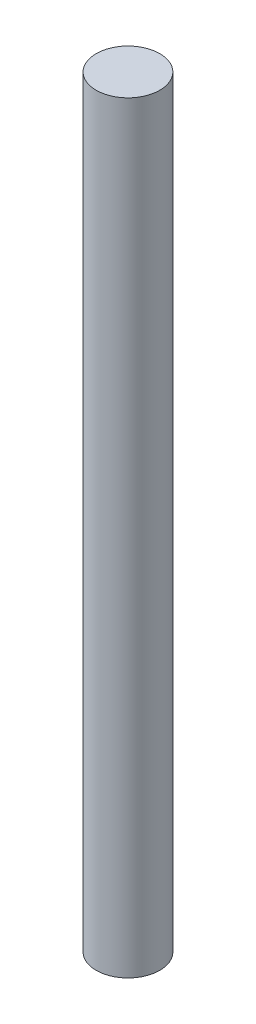
ISO-10303-21;
HEADER;
FILE_DESCRIPTION(('STEP AP214'),'2;1');
FILE_NAME('part.step','',(''),(''),'','','');
FILE_SCHEMA(('AUTOMOTIVE_DESIGN { 1 0 10303 214 1 1 1 1 }'));
ENDSEC;
DATA;
#1=APPLICATION_CONTEXT('core data for automotive mechanical design processes');
#2=APPLICATION_PROTOCOL_DEFINITION('international standard','automotive_design',2000,#1);
#3=PRODUCT_CONTEXT('',#1,'mechanical');
#4=PRODUCT('Part','Part','',(#3));
#5=PRODUCT_RELATED_PRODUCT_CATEGORY('part','',(#4));
#6=PRODUCT_DEFINITION_FORMATION('','',#4);
#7=PRODUCT_DEFINITION_CONTEXT('part definition',#1,'design');
#8=PRODUCT_DEFINITION('design','',#6,#7);
#9=PRODUCT_DEFINITION_SHAPE('','',#8);
#10=(LENGTH_UNIT() NAMED_UNIT(*) SI_UNIT(.MILLI.,.METRE.));
#11=(NAMED_UNIT(*) PLANE_ANGLE_UNIT() SI_UNIT($,.RADIAN.));
#12=(NAMED_UNIT(*) SI_UNIT($,.STERADIAN.) SOLID_ANGLE_UNIT());
#13=UNCERTAINTY_MEASURE_WITH_UNIT(LENGTH_MEASURE(1.E-05),#10,'distance_accuracy_value','');
#14=(GEOMETRIC_REPRESENTATION_CONTEXT(3) GLOBAL_UNCERTAINTY_ASSIGNED_CONTEXT((#13)) GLOBAL_UNIT_ASSIGNED_CONTEXT((#10,
#11,#12)) REPRESENTATION_CONTEXT('',''));
#15=CARTESIAN_POINT('',(0.,0.,0.));
#16=DIRECTION('',(0.,0.,1.));
#17=DIRECTION('',(1.,0.,0.));
#18=AXIS2_PLACEMENT_3D('',#15,#16,#17);
#19=CARTESIAN_POINT('',(0.,36.,0.));
#20=DIRECTION('',(0.,-1.,0.));
#21=DIRECTION('',(0.,0.,-1.));
#22=AXIS2_PLACEMENT_3D('',#19,#20,#21);
#23=CYLINDRICAL_SURFACE('',#22,1.5);
#24=CARTESIAN_POINT('',(0.,36.,0.));
#25=DIRECTION('',(0.,1.,0.));
#26=DIRECTION('',(0.,0.,1.));
#27=AXIS2_PLACEMENT_3D('',#24,#25,#26);
#28=CIRCLE('',#27,1.5);
#29=CARTESIAN_POINT('',(0.,36.,1.5));
#30=VERTEX_POINT('',#29);
#31=EDGE_CURVE('E10',#30,#30,#28,.T.);
#32=ORIENTED_EDGE('',*,*,#31,.F.);
#33=EDGE_LOOP('',(#32));
#34=FACE_BOUND('',#33,.T.);
#35=CARTESIAN_POINT('',(0.,0.,0.));
#36=DIRECTION('',(0.,1.,0.));
#37=DIRECTION('',(0.,0.,1.));
#38=AXIS2_PLACEMENT_3D('',#35,#36,#37);
#39=CIRCLE('',#38,1.5);
#40=CARTESIAN_POINT('',(0.,0.,1.5));
#41=VERTEX_POINT('',#40);
#42=EDGE_CURVE('E34',#41,#41,#39,.T.);
#43=ORIENTED_EDGE('',*,*,#42,.T.);
#44=EDGE_LOOP('',(#43));
#45=FACE_BOUND('',#44,.T.);
#46=ADVANCED_FACE('F31',(#34,#45),#23,.T.);
#47=CARTESIAN_POINT('',(0.,36.,0.));
#48=DIRECTION('',(0.,1.,0.));
#49=DIRECTION('',(0.,0.,1.));
#50=AXIS2_PLACEMENT_3D('',#47,#48,#49);
#51=PLANE('',#50);
#52=ORIENTED_EDGE('',*,*,#31,.T.);
#53=EDGE_LOOP('',(#52));
#54=FACE_BOUND('',#53,.T.);
#55=ADVANCED_FACE('F46',(#54),#51,.T.);
#56=CARTESIAN_POINT('',(0.,0.,0.));
#57=DIRECTION('',(0.,1.,0.));
#58=DIRECTION('',(0.,0.,1.));
#59=AXIS2_PLACEMENT_3D('',#56,#57,#58);
#60=PLANE('',#59);
#61=ORIENTED_EDGE('',*,*,#42,.F.);
#62=EDGE_LOOP('',(#61));
#63=FACE_BOUND('',#62,.T.);
#64=ADVANCED_FACE('F44',(#63),#60,.F.);
#65=CLOSED_SHELL('',(#46,#55,#64));
#66=MANIFOLD_SOLID_BREP('B2',#65);
#67=ADVANCED_BREP_SHAPE_REPRESENTATION('',(#18,#66),#14);
#68=SHAPE_DEFINITION_REPRESENTATION(#9,#67);
ENDSEC;
END-ISO-10303-21;
